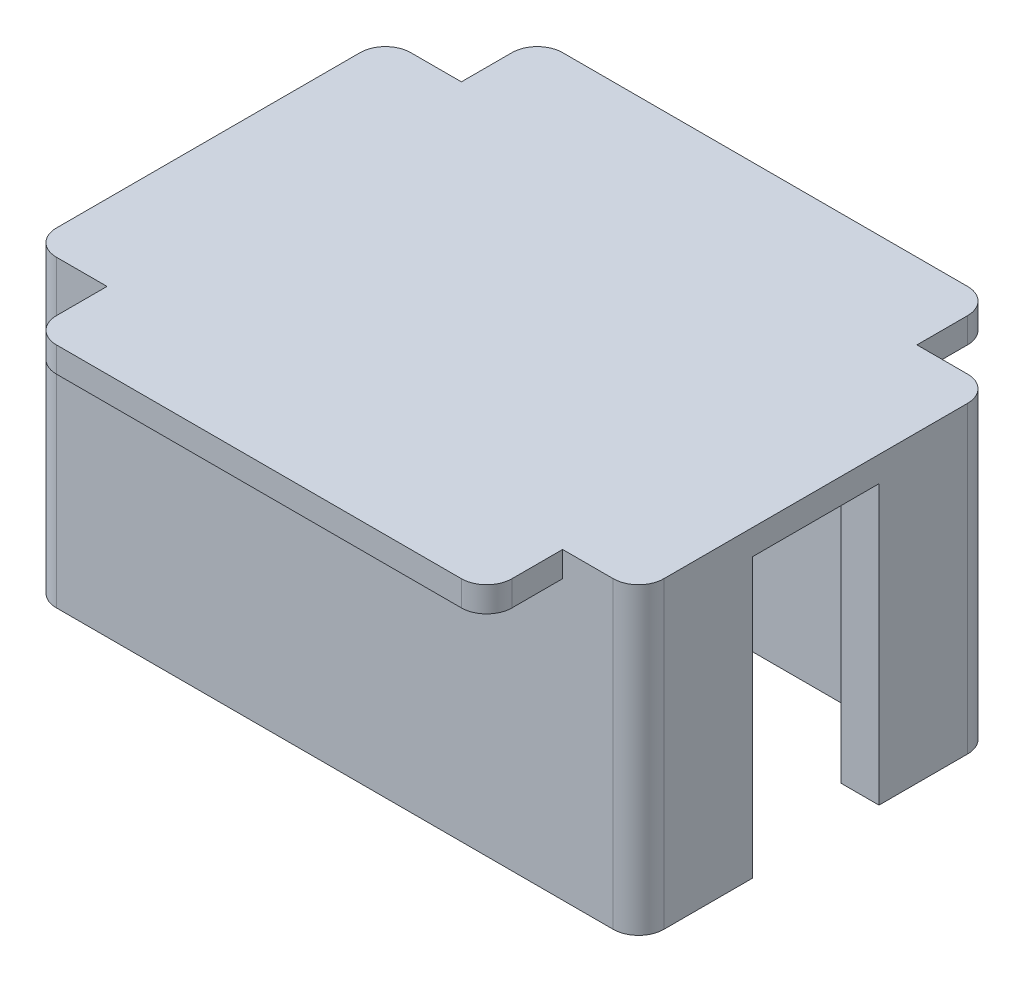
ISO-10303-21;
HEADER;
FILE_DESCRIPTION(('STEP AP214'),'2;1');
FILE_NAME('part.step','',(''),(''),'','','');
FILE_SCHEMA(('AUTOMOTIVE_DESIGN { 1 0 10303 214 1 1 1 1 }'));
ENDSEC;
DATA;
#1=APPLICATION_CONTEXT('core data for automotive mechanical design processes');
#2=APPLICATION_PROTOCOL_DEFINITION('international standard','automotive_design',2000,#1);
#3=PRODUCT_CONTEXT('',#1,'mechanical');
#4=PRODUCT('Part','Part','',(#3));
#5=PRODUCT_RELATED_PRODUCT_CATEGORY('part','',(#4));
#6=PRODUCT_DEFINITION_FORMATION('','',#4);
#7=PRODUCT_DEFINITION_CONTEXT('part definition',#1,'design');
#8=PRODUCT_DEFINITION('design','',#6,#7);
#9=PRODUCT_DEFINITION_SHAPE('','',#8);
#10=(LENGTH_UNIT() NAMED_UNIT(*) SI_UNIT(.MILLI.,.METRE.));
#11=(NAMED_UNIT(*) PLANE_ANGLE_UNIT() SI_UNIT($,.RADIAN.));
#12=(NAMED_UNIT(*) SI_UNIT($,.STERADIAN.) SOLID_ANGLE_UNIT());
#13=UNCERTAINTY_MEASURE_WITH_UNIT(LENGTH_MEASURE(1.E-05),#10,'distance_accuracy_value','');
#14=(GEOMETRIC_REPRESENTATION_CONTEXT(3) GLOBAL_UNCERTAINTY_ASSIGNED_CONTEXT((#13)) GLOBAL_UNIT_ASSIGNED_CONTEXT((#10,
#11,#12)) REPRESENTATION_CONTEXT('',''));
#15=CARTESIAN_POINT('',(0.,0.,0.));
#16=DIRECTION('',(0.,0.,1.));
#17=DIRECTION('',(1.,0.,0.));
#18=AXIS2_PLACEMENT_3D('',#15,#16,#17);
#19=CARTESIAN_POINT('',(24.5,-22.,8.));
#20=DIRECTION('',(1.,0.,0.));
#21=DIRECTION('',(0.,0.,-1.));
#22=AXIS2_PLACEMENT_3D('',#19,#20,#21);
#23=PLANE('',#22);
#24=DIRECTION('',(0.,0.,-1.));
#25=VECTOR('',#24,1.);
#26=CARTESIAN_POINT('',(24.5,-22.,8.));
#27=LINE('',#26,#25);
#28=CARTESIAN_POINT('',(24.5,-22.,-7.5));
#29=VERTEX_POINT('',#28);
#30=CARTESIAN_POINT('',(24.5,-22.,-13.));
#31=VERTEX_POINT('',#30);
#32=EDGE_CURVE('E322',#29,#31,#27,.T.);
#33=ORIENTED_EDGE('',*,*,#32,.F.);
#34=DIRECTION('',(0.,-1.,0.));
#35=VECTOR('',#34,1.);
#36=CARTESIAN_POINT('',(24.5,10.4403065089106,-7.5));
#37=LINE('',#36,#35);
#38=CARTESIAN_POINT('',(24.5,0.,-7.5));
#39=VERTEX_POINT('',#38);
#40=EDGE_CURVE('E251',#39,#29,#37,.T.);
#41=ORIENTED_EDGE('',*,*,#40,.F.);
#42=DIRECTION('',(0.,0.,-1.));
#43=VECTOR('',#42,1.);
#44=CARTESIAN_POINT('',(24.5,0.,8.));
#45=LINE('',#44,#43);
#46=CARTESIAN_POINT('',(24.5,0.,-13.));
#47=VERTEX_POINT('',#46);
#48=EDGE_CURVE('E239',#39,#47,#45,.T.);
#49=ORIENTED_EDGE('',*,*,#48,.T.);
#50=DIRECTION('',(0.,1.,0.));
#51=VECTOR('',#50,1.);
#52=CARTESIAN_POINT('',(24.5,-22.,-13.));
#53=LINE('',#52,#51);
#54=EDGE_CURVE('E331',#31,#47,#53,.T.);
#55=ORIENTED_EDGE('',*,*,#54,.F.);
#56=EDGE_LOOP('',(#33,#41,#49,#55));
#57=FACE_BOUND('',#56,.T.);
#58=ADVANCED_FACE('F39',(#57),#23,.F.);
#59=CARTESIAN_POINT('',(27.5,-22.,11.5));
#60=DIRECTION('',(1.,0.,0.));
#61=DIRECTION('',(0.,0.,-1.));
#62=AXIS2_PLACEMENT_3D('',#59,#60,#61);
#63=PLANE('',#62);
#64=DIRECTION('',(0.,-1.,0.));
#65=VECTOR('',#64,1.);
#66=CARTESIAN_POINT('',(27.5,10.4403065089106,-7.5));
#67=LINE('',#66,#65);
#68=CARTESIAN_POINT('',(27.5,0.,-7.5));
#69=VERTEX_POINT('',#68);
#70=CARTESIAN_POINT('',(27.5,-22.,-7.5));
#71=VERTEX_POINT('',#70);
#72=EDGE_CURVE('E223',#69,#71,#67,.T.);
#73=ORIENTED_EDGE('',*,*,#72,.T.);
#74=DIRECTION('',(0.,0.,-1.));
#75=VECTOR('',#74,1.);
#76=CARTESIAN_POINT('',(27.5,-22.,11.5));
#77=LINE('',#76,#75);
#78=CARTESIAN_POINT('',(27.5,-22.,-14.5));
#79=VERTEX_POINT('',#78);
#80=EDGE_CURVE('E347',#71,#79,#77,.T.);
#81=ORIENTED_EDGE('',*,*,#80,.T.);
#82=DIRECTION('',(0.,1.,0.));
#83=VECTOR('',#82,1.);
#84=CARTESIAN_POINT('',(27.5,-22.,-14.5));
#85=LINE('',#84,#83);
#86=CARTESIAN_POINT('',(27.5,2.,-14.5));
#87=VERTEX_POINT('',#86);
#88=EDGE_CURVE('E396',#79,#87,#85,.T.);
#89=ORIENTED_EDGE('',*,*,#88,.T.);
#90=DIRECTION('',(0.,0.,-1.));
#91=VECTOR('',#90,1.);
#92=CARTESIAN_POINT('',(27.5,2.,11.5));
#93=LINE('',#92,#91);
#94=CARTESIAN_POINT('',(27.5,2.,9.5));
#95=VERTEX_POINT('',#94);
#96=EDGE_CURVE('E302',#95,#87,#93,.T.);
#97=ORIENTED_EDGE('',*,*,#96,.F.);
#98=DIRECTION('',(0.,1.,0.));
#99=VECTOR('',#98,1.);
#100=CARTESIAN_POINT('',(27.5,-22.,9.5));
#101=LINE('',#100,#99);
#102=CARTESIAN_POINT('',(27.5,-22.,9.5));
#103=VERTEX_POINT('',#102);
#104=EDGE_CURVE('E394',#95,#103,#101,.F.);
#105=ORIENTED_EDGE('',*,*,#104,.T.);
#106=CARTESIAN_POINT('',(27.5,-22.,2.5));
#107=VERTEX_POINT('',#106);
#108=EDGE_CURVE('E356',#103,#107,#77,.T.);
#109=ORIENTED_EDGE('',*,*,#108,.T.);
#110=DIRECTION('',(0.,-1.,0.));
#111=VECTOR('',#110,1.);
#112=CARTESIAN_POINT('',(27.5,10.4403065089106,2.5));
#113=LINE('',#112,#111);
#114=CARTESIAN_POINT('',(27.5,0.,2.5));
#115=VERTEX_POINT('',#114);
#116=EDGE_CURVE('E244',#115,#107,#113,.T.);
#117=ORIENTED_EDGE('',*,*,#116,.F.);
#118=DIRECTION('',(0.,0.,1.));
#119=VECTOR('',#118,1.);
#120=CARTESIAN_POINT('',(27.5,0.,2.5));
#121=LINE('',#120,#119);
#122=EDGE_CURVE('E233',#69,#115,#121,.T.);
#123=ORIENTED_EDGE('',*,*,#122,.F.);
#124=EDGE_LOOP('',(#73,#81,#89,#97,#105,#109,#117,#123));
#125=FACE_BOUND('',#124,.T.);
#126=ADVANCED_FACE('F242',(#125),#63,.T.);
#127=CARTESIAN_POINT('',(27.5,-22.,11.5));
#128=DIRECTION('',(0.,0.,1.));
#129=DIRECTION('',(1.,0.,0.));
#130=AXIS2_PLACEMENT_3D('',#127,#128,#129);
#131=PLANE('',#130);
#132=DIRECTION('',(0.,1.,0.));
#133=VECTOR('',#132,1.);
#134=CARTESIAN_POINT('',(21.5,0.,11.5));
#135=LINE('',#134,#133);
#136=CARTESIAN_POINT('',(21.5,0.,11.5));
#137=VERTEX_POINT('',#136);
#138=CARTESIAN_POINT('',(21.5,2.,11.5));
#139=VERTEX_POINT('',#138);
#140=EDGE_CURVE('E254',#137,#139,#135,.T.);
#141=ORIENTED_EDGE('',*,*,#140,.F.);
#142=DIRECTION('',(-1.,0.,0.));
#143=VECTOR('',#142,1.);
#144=CARTESIAN_POINT('',(-14.5,0.,11.5));
#145=LINE('',#144,#143);
#146=CARTESIAN_POINT('',(-14.5,0.,11.5));
#147=VERTEX_POINT('',#146);
#148=EDGE_CURVE('E264',#137,#147,#145,.T.);
#149=ORIENTED_EDGE('',*,*,#148,.T.);
#150=DIRECTION('',(0.,1.,0.));
#151=VECTOR('',#150,1.);
#152=CARTESIAN_POINT('',(-14.5,0.,11.5));
#153=LINE('',#152,#151);
#154=CARTESIAN_POINT('',(-14.5,2.,11.5));
#155=VERTEX_POINT('',#154);
#156=EDGE_CURVE('E255',#147,#155,#153,.T.);
#157=ORIENTED_EDGE('',*,*,#156,.T.);
#158=DIRECTION('',(1.,0.,0.));
#159=VECTOR('',#158,1.);
#160=CARTESIAN_POINT('',(27.5,2.,11.5));
#161=LINE('',#160,#159);
#162=CARTESIAN_POINT('',(-18.5,2.,11.5));
#163=VERTEX_POINT('',#162);
#164=EDGE_CURVE('E315',#163,#155,#161,.T.);
#165=ORIENTED_EDGE('',*,*,#164,.F.);
#166=DIRECTION('',(0.,1.,0.));
#167=VECTOR('',#166,1.);
#168=CARTESIAN_POINT('',(-18.5,-22.,11.5));
#169=LINE('',#168,#167);
#170=CARTESIAN_POINT('',(-18.5,-22.,11.5));
#171=VERTEX_POINT('',#170);
#172=EDGE_CURVE('E402',#163,#171,#169,.F.);
#173=ORIENTED_EDGE('',*,*,#172,.T.);
#174=DIRECTION('',(1.,0.,0.));
#175=VECTOR('',#174,1.);
#176=CARTESIAN_POINT('',(27.5,-22.,11.5));
#177=LINE('',#176,#175);
#178=CARTESIAN_POINT('',(25.5,-22.,11.5));
#179=VERTEX_POINT('',#178);
#180=EDGE_CURVE('E364',#171,#179,#177,.T.);
#181=ORIENTED_EDGE('',*,*,#180,.T.);
#182=DIRECTION('',(0.,1.,0.));
#183=VECTOR('',#182,1.);
#184=CARTESIAN_POINT('',(25.5,-22.,11.5));
#185=LINE('',#184,#183);
#186=CARTESIAN_POINT('',(25.5,2.,11.5));
#187=VERTEX_POINT('',#186);
#188=EDGE_CURVE('E399',#179,#187,#185,.T.);
#189=ORIENTED_EDGE('',*,*,#188,.T.);
#190=EDGE_CURVE('E314',#139,#187,#161,.T.);
#191=ORIENTED_EDGE('',*,*,#190,.F.);
#192=EDGE_LOOP('',(#141,#149,#157,#165,#173,#181,#189,#191));
#193=FACE_BOUND('',#192,.T.);
#194=ADVANCED_FACE('F482',(#193),#131,.T.);
#195=CARTESIAN_POINT('',(-20.5,-22.,11.5));
#196=DIRECTION('',(-1.,0.,0.));
#197=DIRECTION('',(0.,0.,1.));
#198=AXIS2_PLACEMENT_3D('',#195,#196,#197);
#199=PLANE('',#198);
#200=DIRECTION('',(0.,0.,1.));
#201=VECTOR('',#200,1.);
#202=CARTESIAN_POINT('',(-20.5,2.,11.5));
#203=LINE('',#202,#201);
#204=CARTESIAN_POINT('',(-20.5,2.,-14.5));
#205=VERTEX_POINT('',#204);
#206=CARTESIAN_POINT('',(-20.5,2.,9.5));
#207=VERTEX_POINT('',#206);
#208=EDGE_CURVE('E311',#205,#207,#203,.T.);
#209=ORIENTED_EDGE('',*,*,#208,.F.);
#210=DIRECTION('',(0.,1.,0.));
#211=VECTOR('',#210,1.);
#212=CARTESIAN_POINT('',(-20.5,-22.,-14.5));
#213=LINE('',#212,#211);
#214=CARTESIAN_POINT('',(-20.5,-22.,-14.5));
#215=VERTEX_POINT('',#214);
#216=EDGE_CURVE('E383',#205,#215,#213,.F.);
#217=ORIENTED_EDGE('',*,*,#216,.T.);
#218=DIRECTION('',(0.,0.,1.));
#219=VECTOR('',#218,1.);
#220=CARTESIAN_POINT('',(-20.5,-22.,11.5));
#221=LINE('',#220,#219);
#222=CARTESIAN_POINT('',(-20.5,-22.,9.5));
#223=VERTEX_POINT('',#222);
#224=EDGE_CURVE('E361',#215,#223,#221,.T.);
#225=ORIENTED_EDGE('',*,*,#224,.T.);
#226=DIRECTION('',(0.,1.,0.));
#227=VECTOR('',#226,1.);
#228=CARTESIAN_POINT('',(-20.5,-22.,9.5));
#229=LINE('',#228,#227);
#230=EDGE_CURVE('E380',#223,#207,#229,.T.);
#231=ORIENTED_EDGE('',*,*,#230,.T.);
#232=EDGE_LOOP('',(#209,#217,#225,#231));
#233=FACE_BOUND('',#232,.T.);
#234=ADVANCED_FACE('F469',(#233),#199,.T.);
#235=CARTESIAN_POINT('',(27.5,-22.,-16.5));
#236=DIRECTION('',(0.,0.,-1.));
#237=DIRECTION('',(-1.,0.,0.));
#238=AXIS2_PLACEMENT_3D('',#235,#236,#237);
#239=PLANE('',#238);
#240=DIRECTION('',(0.,1.,0.));
#241=VECTOR('',#240,1.);
#242=CARTESIAN_POINT('',(-14.5,0.,-16.5));
#243=LINE('',#242,#241);
#244=CARTESIAN_POINT('',(-14.5,0.,-16.5));
#245=VERTEX_POINT('',#244);
#246=CARTESIAN_POINT('',(-14.5,2.,-16.5));
#247=VERTEX_POINT('',#246);
#248=EDGE_CURVE('E292',#245,#247,#243,.T.);
#249=ORIENTED_EDGE('',*,*,#248,.F.);
#250=DIRECTION('',(1.,0.,0.));
#251=VECTOR('',#250,1.);
#252=CARTESIAN_POINT('',(-14.5,0.,-16.5));
#253=LINE('',#252,#251);
#254=CARTESIAN_POINT('',(21.5,0.,-16.5));
#255=VERTEX_POINT('',#254);
#256=EDGE_CURVE('E282',#245,#255,#253,.T.);
#257=ORIENTED_EDGE('',*,*,#256,.T.);
#258=DIRECTION('',(0.,1.,0.));
#259=VECTOR('',#258,1.);
#260=CARTESIAN_POINT('',(21.5,0.,-16.5));
#261=LINE('',#260,#259);
#262=CARTESIAN_POINT('',(21.5,2.,-16.5));
#263=VERTEX_POINT('',#262);
#264=EDGE_CURVE('E299',#255,#263,#261,.T.);
#265=ORIENTED_EDGE('',*,*,#264,.T.);
#266=DIRECTION('',(-1.,0.,0.));
#267=VECTOR('',#266,1.);
#268=CARTESIAN_POINT('',(27.5,2.,-16.5));
#269=LINE('',#268,#267);
#270=CARTESIAN_POINT('',(25.5,2.,-16.5));
#271=VERTEX_POINT('',#270);
#272=EDGE_CURVE('E308',#271,#263,#269,.T.);
#273=ORIENTED_EDGE('',*,*,#272,.F.);
#274=DIRECTION('',(0.,1.,0.));
#275=VECTOR('',#274,1.);
#276=CARTESIAN_POINT('',(25.5,-22.,-16.5));
#277=LINE('',#276,#275);
#278=CARTESIAN_POINT('',(25.5,-22.,-16.5));
#279=VERTEX_POINT('',#278);
#280=EDGE_CURVE('E367',#271,#279,#277,.F.);
#281=ORIENTED_EDGE('',*,*,#280,.T.);
#282=DIRECTION('',(-1.,0.,0.));
#283=VECTOR('',#282,1.);
#284=CARTESIAN_POINT('',(27.5,-22.,-16.5));
#285=LINE('',#284,#283);
#286=CARTESIAN_POINT('',(-18.5,-22.,-16.5));
#287=VERTEX_POINT('',#286);
#288=EDGE_CURVE('E358',#279,#287,#285,.T.);
#289=ORIENTED_EDGE('',*,*,#288,.T.);
#290=DIRECTION('',(0.,1.,0.));
#291=VECTOR('',#290,1.);
#292=CARTESIAN_POINT('',(-18.5,-22.,-16.5));
#293=LINE('',#292,#291);
#294=CARTESIAN_POINT('',(-18.5,2.,-16.5));
#295=VERTEX_POINT('',#294);
#296=EDGE_CURVE('E369',#287,#295,#293,.T.);
#297=ORIENTED_EDGE('',*,*,#296,.T.);
#298=EDGE_CURVE('E307',#247,#295,#269,.T.);
#299=ORIENTED_EDGE('',*,*,#298,.F.);
#300=EDGE_LOOP('',(#249,#257,#265,#273,#281,#289,#297,#299));
#301=FACE_BOUND('',#300,.T.);
#302=ADVANCED_FACE('F459',(#301),#239,.T.);
#303=CARTESIAN_POINT('',(0.,-22.,0.));
#304=DIRECTION('',(0.,1.,0.));
#305=DIRECTION('',(0.,0.,1.));
#306=AXIS2_PLACEMENT_3D('',#303,#304,#305);
#307=PLANE('',#306);
#308=ORIENTED_EDGE('',*,*,#80,.F.);
#309=DIRECTION('',(1.,0.,0.));
#310=VECTOR('',#309,1.);
#311=CARTESIAN_POINT('',(27.5,-22.,-7.5));
#312=LINE('',#311,#310);
#313=EDGE_CURVE('E229',#29,#71,#312,.T.);
#314=ORIENTED_EDGE('',*,*,#313,.F.);
#315=ORIENTED_EDGE('',*,*,#32,.T.);
#316=DIRECTION('',(-1.,0.,0.));
#317=VECTOR('',#316,1.);
#318=CARTESIAN_POINT('',(24.5,-22.,-13.));
#319=LINE('',#318,#317);
#320=CARTESIAN_POINT('',(-17.5,-22.,-13.));
#321=VERTEX_POINT('',#320);
#322=EDGE_CURVE('E321',#31,#321,#319,.T.);
#323=ORIENTED_EDGE('',*,*,#322,.T.);
#324=DIRECTION('',(0.,0.,1.));
#325=VECTOR('',#324,1.);
#326=CARTESIAN_POINT('',(-17.5,-22.,8.));
#327=LINE('',#326,#325);
#328=CARTESIAN_POINT('',(-17.5,-22.,8.));
#329=VERTEX_POINT('',#328);
#330=EDGE_CURVE('E325',#321,#329,#327,.T.);
#331=ORIENTED_EDGE('',*,*,#330,.T.);
#332=DIRECTION('',(1.,0.,0.));
#333=VECTOR('',#332,1.);
#334=CARTESIAN_POINT('',(24.5,-22.,8.));
#335=LINE('',#334,#333);
#336=CARTESIAN_POINT('',(24.5,-22.,8.));
#337=VERTEX_POINT('',#336);
#338=EDGE_CURVE('E328',#329,#337,#335,.T.);
#339=ORIENTED_EDGE('',*,*,#338,.T.);
#340=CARTESIAN_POINT('',(24.5,-22.,2.5));
#341=VERTEX_POINT('',#340);
#342=EDGE_CURVE('E318',#337,#341,#27,.T.);
#343=ORIENTED_EDGE('',*,*,#342,.T.);
#344=DIRECTION('',(-1.,0.,0.));
#345=VECTOR('',#344,1.);
#346=CARTESIAN_POINT('',(24.5,-22.,2.5));
#347=LINE('',#346,#345);
#348=EDGE_CURVE('E240',#107,#341,#347,.T.);
#349=ORIENTED_EDGE('',*,*,#348,.F.);
#350=ORIENTED_EDGE('',*,*,#108,.F.);
#351=CARTESIAN_POINT('',(25.5,-22.,9.5));
#352=DIRECTION('',(0.,1.,0.));
#353=DIRECTION('',(0.,0.,1.));
#354=AXIS2_PLACEMENT_3D('',#351,#352,#353);
#355=CIRCLE('',#354,2.);
#356=EDGE_CURVE('E385',#103,#179,#355,.F.);
#357=ORIENTED_EDGE('',*,*,#356,.T.);
#358=ORIENTED_EDGE('',*,*,#180,.F.);
#359=CARTESIAN_POINT('',(-18.5,-22.,9.5));
#360=DIRECTION('',(0.,1.,0.));
#361=DIRECTION('',(0.,0.,1.));
#362=AXIS2_PLACEMENT_3D('',#359,#360,#361);
#363=CIRCLE('',#362,2.);
#364=EDGE_CURVE('E387',#171,#223,#363,.F.);
#365=ORIENTED_EDGE('',*,*,#364,.T.);
#366=ORIENTED_EDGE('',*,*,#224,.F.);
#367=CARTESIAN_POINT('',(-18.5,-22.,-14.5));
#368=DIRECTION('',(0.,1.,0.));
#369=DIRECTION('',(0.,0.,1.));
#370=AXIS2_PLACEMENT_3D('',#367,#368,#369);
#371=CIRCLE('',#370,2.);
#372=EDGE_CURVE('E392',#215,#287,#371,.F.);
#373=ORIENTED_EDGE('',*,*,#372,.T.);
#374=ORIENTED_EDGE('',*,*,#288,.F.);
#375=CARTESIAN_POINT('',(25.5,-22.,-14.5));
#376=DIRECTION('',(0.,1.,0.));
#377=DIRECTION('',(0.,0.,1.));
#378=AXIS2_PLACEMENT_3D('',#375,#376,#377);
#379=CIRCLE('',#378,2.);
#380=EDGE_CURVE('E389',#279,#79,#379,.F.);
#381=ORIENTED_EDGE('',*,*,#380,.T.);
#382=EDGE_LOOP('',(#308,#314,#315,#323,#331,#339,#343,#349,#350,#357,#358,#365,#366,#373,#374,#381));
#383=FACE_BOUND('',#382,.T.);
#384=ADVANCED_FACE('F472',(#383),#307,.F.);
#385=CARTESIAN_POINT('',(24.5,0.,8.));
#386=VERTEX_POINT('',#385);
#387=CARTESIAN_POINT('',(24.5,0.,2.5));
#388=VERTEX_POINT('',#387);
#389=EDGE_CURVE('E332',#386,#388,#45,.T.);
#390=ORIENTED_EDGE('',*,*,#389,.T.);
#391=DIRECTION('',(0.,-1.,0.));
#392=VECTOR('',#391,1.);
#393=CARTESIAN_POINT('',(24.5,10.4403065089106,2.5));
#394=LINE('',#393,#392);
#395=EDGE_CURVE('E249',#388,#341,#394,.T.);
#396=ORIENTED_EDGE('',*,*,#395,.T.);
#397=ORIENTED_EDGE('',*,*,#342,.F.);
#398=DIRECTION('',(0.,1.,0.));
#399=VECTOR('',#398,1.);
#400=CARTESIAN_POINT('',(24.5,-22.,8.));
#401=LINE('',#400,#399);
#402=EDGE_CURVE('E344',#337,#386,#401,.T.);
#403=ORIENTED_EDGE('',*,*,#402,.T.);
#404=EDGE_LOOP('',(#390,#396,#397,#403));
#405=FACE_BOUND('',#404,.T.);
#406=ADVANCED_FACE('F522',(#405),#23,.F.);
#407=CARTESIAN_POINT('',(24.5,-22.,8.));
#408=DIRECTION('',(0.,0.,1.));
#409=DIRECTION('',(1.,0.,0.));
#410=AXIS2_PLACEMENT_3D('',#407,#408,#409);
#411=PLANE('',#410);
#412=DIRECTION('',(1.,0.,0.));
#413=VECTOR('',#412,1.);
#414=CARTESIAN_POINT('',(24.5,0.,8.));
#415=LINE('',#414,#413);
#416=CARTESIAN_POINT('',(-17.5,0.,8.));
#417=VERTEX_POINT('',#416);
#418=EDGE_CURVE('E341',#417,#386,#415,.T.);
#419=ORIENTED_EDGE('',*,*,#418,.T.);
#420=ORIENTED_EDGE('',*,*,#402,.F.);
#421=ORIENTED_EDGE('',*,*,#338,.F.);
#422=DIRECTION('',(0.,1.,0.));
#423=VECTOR('',#422,1.);
#424=CARTESIAN_POINT('',(-17.5,-22.,8.));
#425=LINE('',#424,#423);
#426=EDGE_CURVE('E348',#329,#417,#425,.T.);
#427=ORIENTED_EDGE('',*,*,#426,.T.);
#428=EDGE_LOOP('',(#419,#420,#421,#427));
#429=FACE_BOUND('',#428,.T.);
#430=ADVANCED_FACE('F525',(#429),#411,.F.);
#431=CARTESIAN_POINT('',(-17.5,-22.,8.));
#432=DIRECTION('',(-1.,0.,0.));
#433=DIRECTION('',(0.,0.,1.));
#434=AXIS2_PLACEMENT_3D('',#431,#432,#433);
#435=PLANE('',#434);
#436=DIRECTION('',(0.,0.,1.));
#437=VECTOR('',#436,1.);
#438=CARTESIAN_POINT('',(-17.5,0.,8.));
#439=LINE('',#438,#437);
#440=CARTESIAN_POINT('',(-17.5,0.,-13.));
#441=VERTEX_POINT('',#440);
#442=EDGE_CURVE('E338',#441,#417,#439,.T.);
#443=ORIENTED_EDGE('',*,*,#442,.T.);
#444=ORIENTED_EDGE('',*,*,#426,.F.);
#445=ORIENTED_EDGE('',*,*,#330,.F.);
#446=DIRECTION('',(0.,1.,0.));
#447=VECTOR('',#446,1.);
#448=CARTESIAN_POINT('',(-17.5,-22.,-13.));
#449=LINE('',#448,#447);
#450=EDGE_CURVE('E351',#321,#441,#449,.T.);
#451=ORIENTED_EDGE('',*,*,#450,.T.);
#452=EDGE_LOOP('',(#443,#444,#445,#451));
#453=FACE_BOUND('',#452,.T.);
#454=ADVANCED_FACE('F527',(#453),#435,.F.);
#455=CARTESIAN_POINT('',(24.5,-22.,-13.));
#456=DIRECTION('',(0.,0.,-1.));
#457=DIRECTION('',(-1.,0.,0.));
#458=AXIS2_PLACEMENT_3D('',#455,#456,#457);
#459=PLANE('',#458);
#460=DIRECTION('',(-1.,0.,0.));
#461=VECTOR('',#460,1.);
#462=CARTESIAN_POINT('',(24.5,0.,-13.));
#463=LINE('',#462,#461);
#464=EDGE_CURVE('E335',#47,#441,#463,.T.);
#465=ORIENTED_EDGE('',*,*,#464,.T.);
#466=ORIENTED_EDGE('',*,*,#450,.F.);
#467=ORIENTED_EDGE('',*,*,#322,.F.);
#468=ORIENTED_EDGE('',*,*,#54,.T.);
#469=EDGE_LOOP('',(#465,#466,#467,#468));
#470=FACE_BOUND('',#469,.T.);
#471=ADVANCED_FACE('F531',(#470),#459,.F.);
#472=CARTESIAN_POINT('',(0.,0.,0.));
#473=DIRECTION('',(0.,1.,0.));
#474=DIRECTION('',(0.,0.,1.));
#475=AXIS2_PLACEMENT_3D('',#472,#473,#474);
#476=PLANE('',#475);
#477=ORIENTED_EDGE('',*,*,#389,.F.);
#478=ORIENTED_EDGE('',*,*,#418,.F.);
#479=ORIENTED_EDGE('',*,*,#442,.F.);
#480=ORIENTED_EDGE('',*,*,#464,.F.);
#481=ORIENTED_EDGE('',*,*,#48,.F.);
#482=DIRECTION('',(1.,0.,0.));
#483=VECTOR('',#482,1.);
#484=CARTESIAN_POINT('',(27.5,0.,-7.5));
#485=LINE('',#484,#483);
#486=EDGE_CURVE('E226',#39,#69,#485,.T.);
#487=ORIENTED_EDGE('',*,*,#486,.T.);
#488=ORIENTED_EDGE('',*,*,#122,.T.);
#489=DIRECTION('',(-1.,0.,0.));
#490=VECTOR('',#489,1.);
#491=CARTESIAN_POINT('',(24.5,0.,2.5));
#492=LINE('',#491,#490);
#493=EDGE_CURVE('E54',#115,#388,#492,.T.);
#494=ORIENTED_EDGE('',*,*,#493,.T.);
#495=EDGE_LOOP('',(#477,#478,#479,#480,#481,#487,#488,#494));
#496=FACE_BOUND('',#495,.T.);
#497=ADVANCED_FACE('F236',(#496),#476,.F.);
#498=CARTESIAN_POINT('',(0.,2.,0.));
#499=DIRECTION('',(0.,1.,0.));
#500=DIRECTION('',(0.,0.,1.));
#501=AXIS2_PLACEMENT_3D('',#498,#499,#500);
#502=PLANE('',#501);
#503=DIRECTION('',(1.,0.,0.));
#504=VECTOR('',#503,1.);
#505=CARTESIAN_POINT('',(-14.5,2.,17.5));
#506=LINE('',#505,#504);
#507=CARTESIAN_POINT('',(-12.5,2.,17.5));
#508=VERTEX_POINT('',#507);
#509=CARTESIAN_POINT('',(19.5,2.,17.5));
#510=VERTEX_POINT('',#509);
#511=EDGE_CURVE('E263',#508,#510,#506,.T.);
#512=ORIENTED_EDGE('',*,*,#511,.T.);
#513=CARTESIAN_POINT('',(19.5,2.,15.5));
#514=DIRECTION('',(0.,1.,0.));
#515=DIRECTION('',(0.,0.,1.));
#516=AXIS2_PLACEMENT_3D('',#513,#514,#515);
#517=CIRCLE('',#516,2.);
#518=CARTESIAN_POINT('',(21.5,2.,15.5));
#519=VERTEX_POINT('',#518);
#520=EDGE_CURVE('E415',#510,#519,#517,.T.);
#521=ORIENTED_EDGE('',*,*,#520,.T.);
#522=DIRECTION('',(0.,0.,-1.));
#523=VECTOR('',#522,1.);
#524=CARTESIAN_POINT('',(21.5,2.,11.5));
#525=LINE('',#524,#523);
#526=EDGE_CURVE('E261',#519,#139,#525,.T.);
#527=ORIENTED_EDGE('',*,*,#526,.T.);
#528=ORIENTED_EDGE('',*,*,#190,.T.);
#529=CARTESIAN_POINT('',(25.5,2.,9.5));
#530=DIRECTION('',(0.,1.,0.));
#531=DIRECTION('',(0.,0.,1.));
#532=AXIS2_PLACEMENT_3D('',#529,#530,#531);
#533=CIRCLE('',#532,2.);
#534=EDGE_CURVE('E372',#187,#95,#533,.T.);
#535=ORIENTED_EDGE('',*,*,#534,.T.);
#536=ORIENTED_EDGE('',*,*,#96,.T.);
#537=CARTESIAN_POINT('',(25.5,2.,-14.5));
#538=DIRECTION('',(0.,1.,0.));
#539=DIRECTION('',(0.,0.,1.));
#540=AXIS2_PLACEMENT_3D('',#537,#538,#539);
#541=CIRCLE('',#540,2.);
#542=EDGE_CURVE('E376',#87,#271,#541,.T.);
#543=ORIENTED_EDGE('',*,*,#542,.T.);
#544=ORIENTED_EDGE('',*,*,#272,.T.);
#545=DIRECTION('',(0.,0.,-1.));
#546=VECTOR('',#545,1.);
#547=CARTESIAN_POINT('',(21.5,2.,-16.5));
#548=LINE('',#547,#546);
#549=CARTESIAN_POINT('',(21.5,2.,-20.5));
#550=VERTEX_POINT('',#549);
#551=EDGE_CURVE('E294',#263,#550,#548,.T.);
#552=ORIENTED_EDGE('',*,*,#551,.T.);
#553=CARTESIAN_POINT('',(19.5,2.,-20.5));
#554=DIRECTION('',(0.,1.,0.));
#555=DIRECTION('',(0.,0.,1.));
#556=AXIS2_PLACEMENT_3D('',#553,#554,#555);
#557=CIRCLE('',#556,2.);
#558=CARTESIAN_POINT('',(19.5,2.,-22.5));
#559=VERTEX_POINT('',#558);
#560=EDGE_CURVE('E413',#550,#559,#557,.T.);
#561=ORIENTED_EDGE('',*,*,#560,.T.);
#562=DIRECTION('',(-1.,0.,0.));
#563=VECTOR('',#562,1.);
#564=CARTESIAN_POINT('',(-14.5,2.,-22.5));
#565=LINE('',#564,#563);
#566=CARTESIAN_POINT('',(-12.5,2.,-22.5));
#567=VERTEX_POINT('',#566);
#568=EDGE_CURVE('E283',#559,#567,#565,.T.);
#569=ORIENTED_EDGE('',*,*,#568,.T.);
#570=CARTESIAN_POINT('',(-12.5,2.,-20.5));
#571=DIRECTION('',(0.,1.,0.));
#572=DIRECTION('',(0.,0.,1.));
#573=AXIS2_PLACEMENT_3D('',#570,#571,#572);
#574=CIRCLE('',#573,2.);
#575=CARTESIAN_POINT('',(-14.5,2.,-20.5));
#576=VERTEX_POINT('',#575);
#577=EDGE_CURVE('E411',#567,#576,#574,.T.);
#578=ORIENTED_EDGE('',*,*,#577,.T.);
#579=DIRECTION('',(0.,0.,1.));
#580=VECTOR('',#579,1.);
#581=CARTESIAN_POINT('',(-14.5,2.,-16.5));
#582=LINE('',#581,#580);
#583=EDGE_CURVE('E270',#576,#247,#582,.T.);
#584=ORIENTED_EDGE('',*,*,#583,.T.);
#585=ORIENTED_EDGE('',*,*,#298,.T.);
#586=CARTESIAN_POINT('',(-18.5,2.,-14.5));
#587=DIRECTION('',(0.,1.,0.));
#588=DIRECTION('',(0.,0.,1.));
#589=AXIS2_PLACEMENT_3D('',#586,#587,#588);
#590=CIRCLE('',#589,2.);
#591=EDGE_CURVE('E378',#295,#205,#590,.T.);
#592=ORIENTED_EDGE('',*,*,#591,.T.);
#593=ORIENTED_EDGE('',*,*,#208,.T.);
#594=CARTESIAN_POINT('',(-18.5,2.,9.5));
#595=DIRECTION('',(0.,1.,0.));
#596=DIRECTION('',(0.,0.,1.));
#597=AXIS2_PLACEMENT_3D('',#594,#595,#596);
#598=CIRCLE('',#597,2.);
#599=EDGE_CURVE('E374',#207,#163,#598,.T.);
#600=ORIENTED_EDGE('',*,*,#599,.T.);
#601=ORIENTED_EDGE('',*,*,#164,.T.);
#602=DIRECTION('',(0.,0.,1.));
#603=VECTOR('',#602,1.);
#604=CARTESIAN_POINT('',(-14.5,2.,11.5));
#605=LINE('',#604,#603);
#606=CARTESIAN_POINT('',(-14.5,2.,15.5));
#607=VERTEX_POINT('',#606);
#608=EDGE_CURVE('E267',#155,#607,#605,.T.);
#609=ORIENTED_EDGE('',*,*,#608,.T.);
#610=CARTESIAN_POINT('',(-12.5,2.,15.5));
#611=DIRECTION('',(0.,1.,0.));
#612=DIRECTION('',(0.,0.,1.));
#613=AXIS2_PLACEMENT_3D('',#610,#611,#612);
#614=CIRCLE('',#613,2.);
#615=EDGE_CURVE('E409',#607,#508,#614,.T.);
#616=ORIENTED_EDGE('',*,*,#615,.T.);
#617=EDGE_LOOP('',(#512,#521,#527,#528,#535,#536,#543,#544,#552,#561,#569,#578,#584,#585,#592,
#593,#600,#601,#609,#616));
#618=FACE_BOUND('',#617,.T.);
#619=ADVANCED_FACE('F448',(#618),#502,.T.);
#620=CARTESIAN_POINT('',(-18.5,-22.,-14.5));
#621=DIRECTION('',(0.,1.,0.));
#622=DIRECTION('',(0.,0.,1.));
#623=AXIS2_PLACEMENT_3D('',#620,#621,#622);
#624=CYLINDRICAL_SURFACE('',#623,2.);
#625=ORIENTED_EDGE('',*,*,#372,.F.);
#626=ORIENTED_EDGE('',*,*,#216,.F.);
#627=ORIENTED_EDGE('',*,*,#591,.F.);
#628=ORIENTED_EDGE('',*,*,#296,.F.);
#629=EDGE_LOOP('',(#625,#626,#627,#628));
#630=FACE_BOUND('',#629,.T.);
#631=ADVANCED_FACE('F466',(#630),#624,.T.);
#632=CARTESIAN_POINT('',(25.5,-22.,-14.5));
#633=DIRECTION('',(0.,1.,0.));
#634=DIRECTION('',(0.,0.,1.));
#635=AXIS2_PLACEMENT_3D('',#632,#633,#634);
#636=CYLINDRICAL_SURFACE('',#635,2.);
#637=ORIENTED_EDGE('',*,*,#380,.F.);
#638=ORIENTED_EDGE('',*,*,#280,.F.);
#639=ORIENTED_EDGE('',*,*,#542,.F.);
#640=ORIENTED_EDGE('',*,*,#88,.F.);
#641=EDGE_LOOP('',(#637,#638,#639,#640));
#642=FACE_BOUND('',#641,.T.);
#643=ADVANCED_FACE('F540',(#642),#636,.T.);
#644=CARTESIAN_POINT('',(-18.5,-22.,9.5));
#645=DIRECTION('',(0.,1.,0.));
#646=DIRECTION('',(0.,0.,1.));
#647=AXIS2_PLACEMENT_3D('',#644,#645,#646);
#648=CYLINDRICAL_SURFACE('',#647,2.);
#649=ORIENTED_EDGE('',*,*,#364,.F.);
#650=ORIENTED_EDGE('',*,*,#172,.F.);
#651=ORIENTED_EDGE('',*,*,#599,.F.);
#652=ORIENTED_EDGE('',*,*,#230,.F.);
#653=EDGE_LOOP('',(#649,#650,#651,#652));
#654=FACE_BOUND('',#653,.T.);
#655=ADVANCED_FACE('F478',(#654),#648,.T.);
#656=CARTESIAN_POINT('',(25.5,-22.,9.5));
#657=DIRECTION('',(0.,1.,0.));
#658=DIRECTION('',(0.,0.,1.));
#659=AXIS2_PLACEMENT_3D('',#656,#657,#658);
#660=CYLINDRICAL_SURFACE('',#659,2.);
#661=ORIENTED_EDGE('',*,*,#356,.F.);
#662=ORIENTED_EDGE('',*,*,#104,.F.);
#663=ORIENTED_EDGE('',*,*,#534,.F.);
#664=ORIENTED_EDGE('',*,*,#188,.F.);
#665=EDGE_LOOP('',(#661,#662,#663,#664));
#666=FACE_BOUND('',#665,.T.);
#667=ADVANCED_FACE('F513',(#666),#660,.T.);
#668=CARTESIAN_POINT('',(-14.5,0.,-16.5));
#669=DIRECTION('',(-1.,0.,0.));
#670=DIRECTION('',(0.,0.,1.));
#671=AXIS2_PLACEMENT_3D('',#668,#669,#670);
#672=PLANE('',#671);
#673=ORIENTED_EDGE('',*,*,#583,.F.);
#674=DIRECTION('',(0.,1.,0.));
#675=VECTOR('',#674,1.);
#676=CARTESIAN_POINT('',(-14.5,0.,-20.5));
#677=LINE('',#676,#675);
#678=CARTESIAN_POINT('',(-14.5,0.,-20.5));
#679=VERTEX_POINT('',#678);
#680=EDGE_CURVE('E47',#576,#679,#677,.F.);
#681=ORIENTED_EDGE('',*,*,#680,.T.);
#682=DIRECTION('',(0.,0.,1.));
#683=VECTOR('',#682,1.);
#684=CARTESIAN_POINT('',(-14.5,0.,-16.5));
#685=LINE('',#684,#683);
#686=EDGE_CURVE('E280',#679,#245,#685,.T.);
#687=ORIENTED_EDGE('',*,*,#686,.T.);
#688=ORIENTED_EDGE('',*,*,#248,.T.);
#689=EDGE_LOOP('',(#673,#681,#687,#688));
#690=FACE_BOUND('',#689,.T.);
#691=ADVANCED_FACE('F455',(#690),#672,.T.);
#692=CARTESIAN_POINT('',(-14.5,0.,-22.5));
#693=DIRECTION('',(0.,0.,-1.));
#694=DIRECTION('',(-1.,0.,0.));
#695=AXIS2_PLACEMENT_3D('',#692,#693,#694);
#696=PLANE('',#695);
#697=ORIENTED_EDGE('',*,*,#568,.F.);
#698=DIRECTION('',(0.,1.,0.));
#699=VECTOR('',#698,1.);
#700=CARTESIAN_POINT('',(19.5,0.,-22.5));
#701=LINE('',#700,#699);
#702=CARTESIAN_POINT('',(19.5,0.,-22.5));
#703=VERTEX_POINT('',#702);
#704=EDGE_CURVE('E429',#559,#703,#701,.F.);
#705=ORIENTED_EDGE('',*,*,#704,.T.);
#706=DIRECTION('',(-1.,0.,0.));
#707=VECTOR('',#706,1.);
#708=CARTESIAN_POINT('',(-14.5,0.,-22.5));
#709=LINE('',#708,#707);
#710=CARTESIAN_POINT('',(-12.5,0.,-22.5));
#711=VERTEX_POINT('',#710);
#712=EDGE_CURVE('E289',#703,#711,#709,.T.);
#713=ORIENTED_EDGE('',*,*,#712,.T.);
#714=DIRECTION('',(0.,1.,0.));
#715=VECTOR('',#714,1.);
#716=CARTESIAN_POINT('',(-12.5,0.,-22.5));
#717=LINE('',#716,#715);
#718=EDGE_CURVE('E426',#711,#567,#717,.T.);
#719=ORIENTED_EDGE('',*,*,#718,.T.);
#720=EDGE_LOOP('',(#697,#705,#713,#719));
#721=FACE_BOUND('',#720,.T.);
#722=ADVANCED_FACE('F450',(#721),#696,.T.);
#723=CARTESIAN_POINT('',(21.5,0.,-16.5));
#724=DIRECTION('',(1.,0.,0.));
#725=DIRECTION('',(0.,0.,-1.));
#726=AXIS2_PLACEMENT_3D('',#723,#724,#725);
#727=PLANE('',#726);
#728=DIRECTION('',(0.,0.,-1.));
#729=VECTOR('',#728,1.);
#730=CARTESIAN_POINT('',(21.5,0.,-16.5));
#731=LINE('',#730,#729);
#732=CARTESIAN_POINT('',(21.5,0.,-20.5));
#733=VERTEX_POINT('',#732);
#734=EDGE_CURVE('E286',#255,#733,#731,.T.);
#735=ORIENTED_EDGE('',*,*,#734,.T.);
#736=DIRECTION('',(0.,1.,0.));
#737=VECTOR('',#736,1.);
#738=CARTESIAN_POINT('',(21.5,0.,-20.5));
#739=LINE('',#738,#737);
#740=EDGE_CURVE('E423',#733,#550,#739,.T.);
#741=ORIENTED_EDGE('',*,*,#740,.T.);
#742=ORIENTED_EDGE('',*,*,#551,.F.);
#743=ORIENTED_EDGE('',*,*,#264,.F.);
#744=EDGE_LOOP('',(#735,#741,#742,#743));
#745=FACE_BOUND('',#744,.T.);
#746=ADVANCED_FACE('F444',(#745),#727,.T.);
#747=CARTESIAN_POINT('',(0.,0.,0.));
#748=DIRECTION('',(0.,-1.,0.));
#749=DIRECTION('',(0.,0.,-1.));
#750=AXIS2_PLACEMENT_3D('',#747,#748,#749);
#751=PLANE('',#750);
#752=ORIENTED_EDGE('',*,*,#712,.F.);
#753=CARTESIAN_POINT('',(19.5,0.,-20.5));
#754=DIRECTION('',(0.,-1.,0.));
#755=DIRECTION('',(0.,0.,-1.));
#756=AXIS2_PLACEMENT_3D('',#753,#754,#755);
#757=CIRCLE('',#756,2.);
#758=EDGE_CURVE('E433',#703,#733,#757,.T.);
#759=ORIENTED_EDGE('',*,*,#758,.T.);
#760=ORIENTED_EDGE('',*,*,#734,.F.);
#761=ORIENTED_EDGE('',*,*,#256,.F.);
#762=ORIENTED_EDGE('',*,*,#686,.F.);
#763=CARTESIAN_POINT('',(-12.5,0.,-20.5));
#764=DIRECTION('',(0.,-1.,0.));
#765=DIRECTION('',(0.,0.,-1.));
#766=AXIS2_PLACEMENT_3D('',#763,#764,#765);
#767=CIRCLE('',#766,2.);
#768=EDGE_CURVE('E431',#679,#711,#767,.T.);
#769=ORIENTED_EDGE('',*,*,#768,.T.);
#770=EDGE_LOOP('',(#752,#759,#760,#761,#762,#769));
#771=FACE_BOUND('',#770,.T.);
#772=ADVANCED_FACE('F438',(#771),#751,.T.);
#773=CARTESIAN_POINT('',(21.5,0.,11.5));
#774=DIRECTION('',(1.,0.,0.));
#775=DIRECTION('',(0.,0.,-1.));
#776=AXIS2_PLACEMENT_3D('',#773,#774,#775);
#777=PLANE('',#776);
#778=ORIENTED_EDGE('',*,*,#526,.F.);
#779=DIRECTION('',(0.,1.,0.));
#780=VECTOR('',#779,1.);
#781=CARTESIAN_POINT('',(21.5,0.,15.5));
#782=LINE('',#781,#780);
#783=CARTESIAN_POINT('',(21.5,0.,15.5));
#784=VERTEX_POINT('',#783);
#785=EDGE_CURVE('E417',#519,#784,#782,.F.);
#786=ORIENTED_EDGE('',*,*,#785,.T.);
#787=DIRECTION('',(0.,0.,-1.));
#788=VECTOR('',#787,1.);
#789=CARTESIAN_POINT('',(21.5,0.,11.5));
#790=LINE('',#789,#788);
#791=EDGE_CURVE('E258',#784,#137,#790,.T.);
#792=ORIENTED_EDGE('',*,*,#791,.T.);
#793=ORIENTED_EDGE('',*,*,#140,.T.);
#794=EDGE_LOOP('',(#778,#786,#792,#793));
#795=FACE_BOUND('',#794,.T.);
#796=ADVANCED_FACE('F505',(#795),#777,.T.);
#797=CARTESIAN_POINT('',(-14.5,0.,17.5));
#798=DIRECTION('',(0.,0.,1.));
#799=DIRECTION('',(1.,0.,0.));
#800=AXIS2_PLACEMENT_3D('',#797,#798,#799);
#801=PLANE('',#800);
#802=DIRECTION('',(1.,0.,0.));
#803=VECTOR('',#802,1.);
#804=CARTESIAN_POINT('',(-14.5,0.,17.5));
#805=LINE('',#804,#803);
#806=CARTESIAN_POINT('',(-12.5,0.,17.5));
#807=VERTEX_POINT('',#806);
#808=CARTESIAN_POINT('',(19.5,0.,17.5));
#809=VERTEX_POINT('',#808);
#810=EDGE_CURVE('E272',#807,#809,#805,.T.);
#811=ORIENTED_EDGE('',*,*,#810,.T.);
#812=DIRECTION('',(0.,1.,0.));
#813=VECTOR('',#812,1.);
#814=CARTESIAN_POINT('',(19.5,0.,17.5));
#815=LINE('',#814,#813);
#816=EDGE_CURVE('E406',#809,#510,#815,.T.);
#817=ORIENTED_EDGE('',*,*,#816,.T.);
#818=ORIENTED_EDGE('',*,*,#511,.F.);
#819=DIRECTION('',(0.,1.,0.));
#820=VECTOR('',#819,1.);
#821=CARTESIAN_POINT('',(-12.5,0.,17.5));
#822=LINE('',#821,#820);
#823=EDGE_CURVE('E404',#508,#807,#822,.F.);
#824=ORIENTED_EDGE('',*,*,#823,.T.);
#825=EDGE_LOOP('',(#811,#817,#818,#824));
#826=FACE_BOUND('',#825,.T.);
#827=ADVANCED_FACE('F497',(#826),#801,.T.);
#828=CARTESIAN_POINT('',(-14.5,0.,11.5));
#829=DIRECTION('',(-1.,0.,0.));
#830=DIRECTION('',(0.,0.,1.));
#831=AXIS2_PLACEMENT_3D('',#828,#829,#830);
#832=PLANE('',#831);
#833=DIRECTION('',(0.,0.,1.));
#834=VECTOR('',#833,1.);
#835=CARTESIAN_POINT('',(-14.5,0.,11.5));
#836=LINE('',#835,#834);
#837=CARTESIAN_POINT('',(-14.5,0.,15.5));
#838=VERTEX_POINT('',#837);
#839=EDGE_CURVE('E275',#147,#838,#836,.T.);
#840=ORIENTED_EDGE('',*,*,#839,.T.);
#841=DIRECTION('',(0.,1.,0.));
#842=VECTOR('',#841,1.);
#843=CARTESIAN_POINT('',(-14.5,0.,15.5));
#844=LINE('',#843,#842);
#845=EDGE_CURVE('E11',#838,#607,#844,.T.);
#846=ORIENTED_EDGE('',*,*,#845,.T.);
#847=ORIENTED_EDGE('',*,*,#608,.F.);
#848=ORIENTED_EDGE('',*,*,#156,.F.);
#849=EDGE_LOOP('',(#840,#846,#847,#848));
#850=FACE_BOUND('',#849,.T.);
#851=ADVANCED_FACE('F486',(#850),#832,.T.);
#852=CARTESIAN_POINT('',(0.,0.,0.));
#853=DIRECTION('',(0.,-1.,0.));
#854=DIRECTION('',(0.,0.,-1.));
#855=AXIS2_PLACEMENT_3D('',#852,#853,#854);
#856=PLANE('',#855);
#857=ORIENTED_EDGE('',*,*,#791,.F.);
#858=CARTESIAN_POINT('',(19.5,0.,15.5));
#859=DIRECTION('',(0.,-1.,0.));
#860=DIRECTION('',(0.,0.,-1.));
#861=AXIS2_PLACEMENT_3D('',#858,#859,#860);
#862=CIRCLE('',#861,2.);
#863=EDGE_CURVE('E421',#784,#809,#862,.T.);
#864=ORIENTED_EDGE('',*,*,#863,.T.);
#865=ORIENTED_EDGE('',*,*,#810,.F.);
#866=CARTESIAN_POINT('',(-12.5,0.,15.5));
#867=DIRECTION('',(0.,-1.,0.));
#868=DIRECTION('',(0.,0.,-1.));
#869=AXIS2_PLACEMENT_3D('',#866,#867,#868);
#870=CIRCLE('',#869,2.);
#871=EDGE_CURVE('E419',#807,#838,#870,.T.);
#872=ORIENTED_EDGE('',*,*,#871,.T.);
#873=ORIENTED_EDGE('',*,*,#839,.F.);
#874=ORIENTED_EDGE('',*,*,#148,.F.);
#875=EDGE_LOOP('',(#857,#864,#865,#872,#873,#874));
#876=FACE_BOUND('',#875,.T.);
#877=ADVANCED_FACE('F490',(#876),#856,.T.);
#878=CARTESIAN_POINT('',(19.5,0.,15.5));
#879=DIRECTION('',(0.,1.,0.));
#880=DIRECTION('',(0.,0.,1.));
#881=AXIS2_PLACEMENT_3D('',#878,#879,#880);
#882=CYLINDRICAL_SURFACE('',#881,2.);
#883=ORIENTED_EDGE('',*,*,#863,.F.);
#884=ORIENTED_EDGE('',*,*,#785,.F.);
#885=ORIENTED_EDGE('',*,*,#520,.F.);
#886=ORIENTED_EDGE('',*,*,#816,.F.);
#887=EDGE_LOOP('',(#883,#884,#885,#886));
#888=FACE_BOUND('',#887,.T.);
#889=ADVANCED_FACE('F501',(#888),#882,.T.);
#890=CARTESIAN_POINT('',(19.5,0.,-20.5));
#891=DIRECTION('',(0.,1.,0.));
#892=DIRECTION('',(0.,0.,1.));
#893=AXIS2_PLACEMENT_3D('',#890,#891,#892);
#894=CYLINDRICAL_SURFACE('',#893,2.);
#895=ORIENTED_EDGE('',*,*,#758,.F.);
#896=ORIENTED_EDGE('',*,*,#704,.F.);
#897=ORIENTED_EDGE('',*,*,#560,.F.);
#898=ORIENTED_EDGE('',*,*,#740,.F.);
#899=EDGE_LOOP('',(#895,#896,#897,#898));
#900=FACE_BOUND('',#899,.T.);
#901=ADVANCED_FACE('F445',(#900),#894,.T.);
#902=CARTESIAN_POINT('',(-12.5,0.,-20.5));
#903=DIRECTION('',(0.,1.,0.));
#904=DIRECTION('',(0.,0.,1.));
#905=AXIS2_PLACEMENT_3D('',#902,#903,#904);
#906=CYLINDRICAL_SURFACE('',#905,2.);
#907=ORIENTED_EDGE('',*,*,#768,.F.);
#908=ORIENTED_EDGE('',*,*,#680,.F.);
#909=ORIENTED_EDGE('',*,*,#577,.F.);
#910=ORIENTED_EDGE('',*,*,#718,.F.);
#911=EDGE_LOOP('',(#907,#908,#909,#910));
#912=FACE_BOUND('',#911,.T.);
#913=ADVANCED_FACE('F454',(#912),#906,.T.);
#914=CARTESIAN_POINT('',(-12.5,0.,15.5));
#915=DIRECTION('',(0.,1.,0.));
#916=DIRECTION('',(0.,0.,1.));
#917=AXIS2_PLACEMENT_3D('',#914,#915,#916);
#918=CYLINDRICAL_SURFACE('',#917,2.);
#919=ORIENTED_EDGE('',*,*,#871,.F.);
#920=ORIENTED_EDGE('',*,*,#823,.F.);
#921=ORIENTED_EDGE('',*,*,#615,.F.);
#922=ORIENTED_EDGE('',*,*,#845,.F.);
#923=EDGE_LOOP('',(#919,#920,#921,#922));
#924=FACE_BOUND('',#923,.T.);
#925=ADVANCED_FACE('F41',(#924),#918,.T.);
#926=CARTESIAN_POINT('',(27.5,10.4403065089106,-7.5));
#927=DIRECTION('',(0.,0.,-1.));
#928=DIRECTION('',(-1.,0.,0.));
#929=AXIS2_PLACEMENT_3D('',#926,#927,#928);
#930=PLANE('',#929);
#931=ORIENTED_EDGE('',*,*,#40,.T.);
#932=ORIENTED_EDGE('',*,*,#313,.T.);
#933=ORIENTED_EDGE('',*,*,#72,.F.);
#934=ORIENTED_EDGE('',*,*,#486,.F.);
#935=EDGE_LOOP('',(#931,#932,#933,#934));
#936=FACE_BOUND('',#935,.T.);
#937=ADVANCED_FACE('F225',(#936),#930,.F.);
#938=CARTESIAN_POINT('',(24.5,10.4403065089106,2.5));
#939=DIRECTION('',(0.,0.,1.));
#940=DIRECTION('',(1.,0.,0.));
#941=AXIS2_PLACEMENT_3D('',#938,#939,#940);
#942=PLANE('',#941);
#943=ORIENTED_EDGE('',*,*,#116,.T.);
#944=ORIENTED_EDGE('',*,*,#348,.T.);
#945=ORIENTED_EDGE('',*,*,#395,.F.);
#946=ORIENTED_EDGE('',*,*,#493,.F.);
#947=EDGE_LOOP('',(#943,#944,#945,#946));
#948=FACE_BOUND('',#947,.T.);
#949=ADVANCED_FACE('F520',(#948),#942,.F.);
#950=CLOSED_SHELL('',(#58,#126,#194,#234,#302,#384,#406,#430,#454,#471,#497,#619,#631,#643,#655,
#667,#691,#722,#746,#772,#796,#827,#851,#877,#889,#901,#913,#925,#937,#949));
#951=MANIFOLD_SOLID_BREP('B2',#950);
#952=ADVANCED_BREP_SHAPE_REPRESENTATION('',(#18,#951),#14);
#953=SHAPE_DEFINITION_REPRESENTATION(#9,#952);
ENDSEC;
END-ISO-10303-21;
